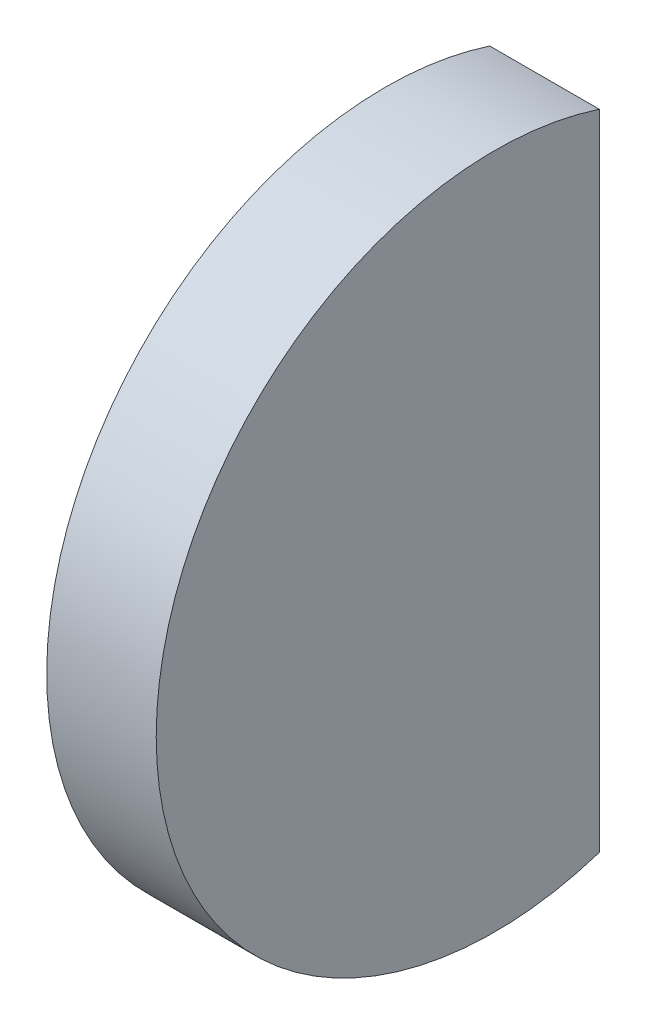
ISO-10303-21;
HEADER;
FILE_DESCRIPTION(('STEP AP214'),'2;1');
FILE_NAME('part.step','',(''),(''),'','','');
FILE_SCHEMA(('AUTOMOTIVE_DESIGN { 1 0 10303 214 1 1 1 1 }'));
ENDSEC;
DATA;
#1=APPLICATION_CONTEXT('core data for automotive mechanical design processes');
#2=APPLICATION_PROTOCOL_DEFINITION('international standard','automotive_design',2000,#1);
#3=PRODUCT_CONTEXT('',#1,'mechanical');
#4=PRODUCT('Part','Part','',(#3));
#5=PRODUCT_RELATED_PRODUCT_CATEGORY('part','',(#4));
#6=PRODUCT_DEFINITION_FORMATION('','',#4);
#7=PRODUCT_DEFINITION_CONTEXT('part definition',#1,'design');
#8=PRODUCT_DEFINITION('design','',#6,#7);
#9=PRODUCT_DEFINITION_SHAPE('','',#8);
#10=(LENGTH_UNIT() NAMED_UNIT(*) SI_UNIT(.MILLI.,.METRE.));
#11=(NAMED_UNIT(*) PLANE_ANGLE_UNIT() SI_UNIT($,.RADIAN.));
#12=(NAMED_UNIT(*) SI_UNIT($,.STERADIAN.) SOLID_ANGLE_UNIT());
#13=UNCERTAINTY_MEASURE_WITH_UNIT(LENGTH_MEASURE(1.E-05),#10,'distance_accuracy_value','');
#14=(GEOMETRIC_REPRESENTATION_CONTEXT(3) GLOBAL_UNCERTAINTY_ASSIGNED_CONTEXT((#13)) GLOBAL_UNIT_ASSIGNED_CONTEXT((#10,
#11,#12)) REPRESENTATION_CONTEXT('',''));
#15=CARTESIAN_POINT('',(0.,0.,0.));
#16=DIRECTION('',(0.,0.,1.));
#17=DIRECTION('',(1.,0.,0.));
#18=AXIS2_PLACEMENT_3D('',#15,#16,#17);
#19=CARTESIAN_POINT('',(32.14,0.,0.));
#20=DIRECTION('',(-1.,0.,0.));
#21=DIRECTION('',(0.,1.,0.));
#22=AXIS2_PLACEMENT_3D('',#19,#20,#21);
#23=SPHERICAL_SURFACE('',#22,32.14);
#24=CARTESIAN_POINT('',(1.94100001655684,0.,0.));
#25=DIRECTION('',(-1.,0.,0.));
#26=DIRECTION('',(0.,0.,1.));
#27=AXIS2_PLACEMENT_3D('',#24,#25,#26);
#28=CIRCLE('',#27,11.);
#29=CARTESIAN_POINT('',(1.94100001655684,-10.4613574644976,-3.4));
#30=VERTEX_POINT('',#29);
#31=CARTESIAN_POINT('',(1.94100001655684,10.4613574644976,-3.4));
#32=VERTEX_POINT('',#31);
#33=EDGE_CURVE('E11',#30,#32,#28,.T.);
#34=ORIENTED_EDGE('',*,*,#33,.T.);
#35=CARTESIAN_POINT('',(32.14,0.,-3.4));
#36=DIRECTION('',(0.,0.,1.));
#37=DIRECTION('',(1.,0.,0.));
#38=AXIS2_PLACEMENT_3D('',#35,#36,#37);
#39=CIRCLE('',#38,31.9596558179214);
#40=EDGE_CURVE('E64',#32,#30,#39,.T.);
#41=ORIENTED_EDGE('',*,*,#40,.T.);
#42=EDGE_LOOP('',(#34,#41));
#43=FACE_BOUND('',#42,.T.);
#44=ADVANCED_FACE('F31',(#43),#23,.T.);
#45=CARTESIAN_POINT('',(0.,0.,0.));
#46=DIRECTION('',(-1.,0.,0.));
#47=DIRECTION('',(0.,0.,1.));
#48=AXIS2_PLACEMENT_3D('',#45,#46,#47);
#49=CYLINDRICAL_SURFACE('',#48,11.);
#50=CARTESIAN_POINT('',(5.5,0.,0.));
#51=DIRECTION('',(-1.,0.,0.));
#52=DIRECTION('',(0.,0.,1.));
#53=AXIS2_PLACEMENT_3D('',#50,#51,#52);
#54=CIRCLE('',#53,11.);
#55=CARTESIAN_POINT('',(5.5,-10.4613574644976,-3.4));
#56=VERTEX_POINT('',#55);
#57=CARTESIAN_POINT('',(5.5,10.4613574644976,-3.4));
#58=VERTEX_POINT('',#57);
#59=EDGE_CURVE('E38',#56,#58,#54,.T.);
#60=ORIENTED_EDGE('',*,*,#59,.T.);
#61=DIRECTION('',(1.,0.,0.));
#62=VECTOR('',#61,1.);
#63=CARTESIAN_POINT('',(0.,10.4613574644976,-3.4));
#64=LINE('',#63,#62);
#65=EDGE_CURVE('E45',#32,#58,#64,.T.);
#66=ORIENTED_EDGE('',*,*,#65,.F.);
#67=ORIENTED_EDGE('',*,*,#33,.F.);
#68=DIRECTION('',(1.,0.,0.));
#69=VECTOR('',#68,1.);
#70=CARTESIAN_POINT('',(0.,-10.4613574644976,-3.4));
#71=LINE('',#70,#69);
#72=EDGE_CURVE('E50',#30,#56,#71,.T.);
#73=ORIENTED_EDGE('',*,*,#72,.T.);
#74=EDGE_LOOP('',(#60,#66,#67,#73));
#75=FACE_BOUND('',#74,.T.);
#76=ADVANCED_FACE('F63',(#75),#49,.T.);
#77=CARTESIAN_POINT('',(5.5,11.,0.));
#78=DIRECTION('',(-1.,0.,0.));
#79=DIRECTION('',(0.,0.,1.));
#80=AXIS2_PLACEMENT_3D('',#77,#78,#79);
#81=PLANE('',#80);
#82=ORIENTED_EDGE('',*,*,#59,.F.);
#83=DIRECTION('',(0.,-1.,0.));
#84=VECTOR('',#83,1.);
#85=CARTESIAN_POINT('',(5.5,0.,-3.4));
#86=LINE('',#85,#84);
#87=EDGE_CURVE('E55',#58,#56,#86,.T.);
#88=ORIENTED_EDGE('',*,*,#87,.F.);
#89=EDGE_LOOP('',(#82,#88));
#90=FACE_BOUND('',#89,.T.);
#91=ADVANCED_FACE('F66',(#90),#81,.F.);
#92=CARTESIAN_POINT('',(0.,0.,-3.4));
#93=DIRECTION('',(0.,0.,1.));
#94=DIRECTION('',(1.,0.,0.));
#95=AXIS2_PLACEMENT_3D('',#92,#93,#94);
#96=PLANE('',#95);
#97=ORIENTED_EDGE('',*,*,#65,.T.);
#98=ORIENTED_EDGE('',*,*,#87,.T.);
#99=ORIENTED_EDGE('',*,*,#72,.F.);
#100=ORIENTED_EDGE('',*,*,#40,.F.);
#101=EDGE_LOOP('',(#97,#98,#99,#100));
#102=FACE_BOUND('',#101,.T.);
#103=ADVANCED_FACE('F56',(#102),#96,.F.);
#104=CLOSED_SHELL('',(#44,#76,#91,#103));
#105=MANIFOLD_SOLID_BREP('B2',#104);
#106=ADVANCED_BREP_SHAPE_REPRESENTATION('',(#18,#105),#14);
#107=SHAPE_DEFINITION_REPRESENTATION(#9,#106);
ENDSEC;
END-ISO-10303-21;
